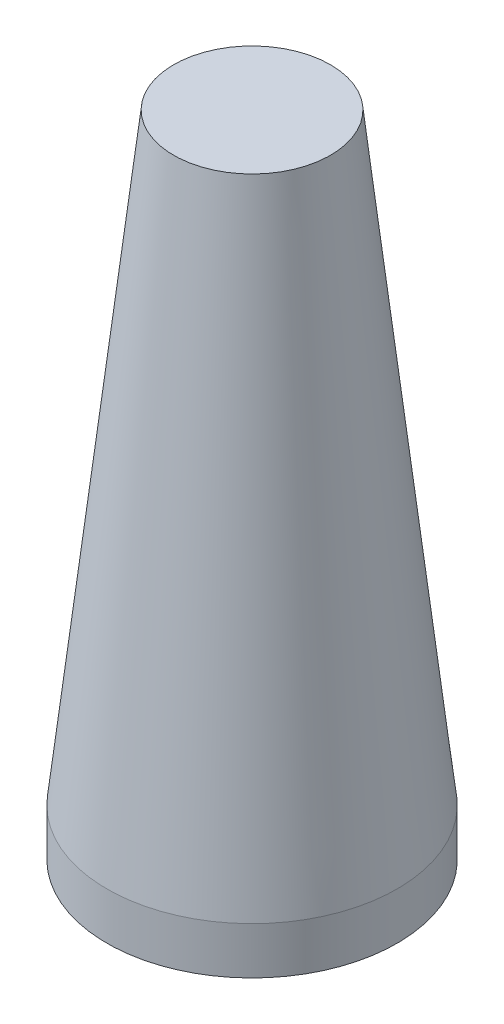
ISO-10303-21;
HEADER;
FILE_DESCRIPTION(('STEP AP214'),'2;1');
FILE_NAME('part.step','',(''),(''),'','','');
FILE_SCHEMA(('AUTOMOTIVE_DESIGN { 1 0 10303 214 1 1 1 1 }'));
ENDSEC;
DATA;
#1=APPLICATION_CONTEXT('core data for automotive mechanical design processes');
#2=APPLICATION_PROTOCOL_DEFINITION('international standard','automotive_design',2000,#1);
#3=PRODUCT_CONTEXT('',#1,'mechanical');
#4=PRODUCT('Part','Part','',(#3));
#5=PRODUCT_RELATED_PRODUCT_CATEGORY('part','',(#4));
#6=PRODUCT_DEFINITION_FORMATION('','',#4);
#7=PRODUCT_DEFINITION_CONTEXT('part definition',#1,'design');
#8=PRODUCT_DEFINITION('design','',#6,#7);
#9=PRODUCT_DEFINITION_SHAPE('','',#8);
#10=(LENGTH_UNIT() NAMED_UNIT(*) SI_UNIT(.MILLI.,.METRE.));
#11=(NAMED_UNIT(*) PLANE_ANGLE_UNIT() SI_UNIT($,.RADIAN.));
#12=(NAMED_UNIT(*) SI_UNIT($,.STERADIAN.) SOLID_ANGLE_UNIT());
#13=UNCERTAINTY_MEASURE_WITH_UNIT(LENGTH_MEASURE(1.E-05),#10,'distance_accuracy_value','');
#14=(GEOMETRIC_REPRESENTATION_CONTEXT(3) GLOBAL_UNCERTAINTY_ASSIGNED_CONTEXT((#13)) GLOBAL_UNIT_ASSIGNED_CONTEXT((#10,
#11,#12)) REPRESENTATION_CONTEXT('',''));
#15=CARTESIAN_POINT('',(0.,0.,0.));
#16=DIRECTION('',(0.,0.,1.));
#17=DIRECTION('',(1.,0.,0.));
#18=AXIS2_PLACEMENT_3D('',#15,#16,#17);
#19=CARTESIAN_POINT('',(0.,790.,0.));
#20=DIRECTION('',(0.,-1.,0.));
#21=DIRECTION('',(0.,0.,-1.));
#22=AXIS2_PLACEMENT_3D('',#19,#20,#21);
#23=PLANE('',#22);
#24=CARTESIAN_POINT('',(0.,790.,0.));
#25=DIRECTION('',(0.,-1.,0.));
#26=DIRECTION('',(0.,0.,-1.));
#27=AXIS2_PLACEMENT_3D('',#24,#25,#26);
#28=CIRCLE('',#27,94.0646952284262);
#29=CARTESIAN_POINT('',(0.,790.,-94.0646952284262));
#30=VERTEX_POINT('',#29);
#31=EDGE_CURVE('E90',#30,#30,#28,.T.);
#32=ORIENTED_EDGE('',*,*,#31,.T.);
#33=EDGE_LOOP('',(#32));
#34=FACE_BOUND('',#33,.T.);
#35=ADVANCED_FACE('F46',(#34),#23,.T.);
#36=CARTESIAN_POINT('',(8.88178419700125E-13,800.,0.));
#37=DIRECTION('',(0.,-1.,0.));
#38=DIRECTION('',(0.,0.,-1.));
#39=AXIS2_PLACEMENT_3D('',#36,#37,#38);
#40=PLANE('',#39);
#41=CARTESIAN_POINT('',(0.,800.,0.));
#42=DIRECTION('',(0.,-1.,0.));
#43=DIRECTION('',(0.,0.,-1.));
#44=AXIS2_PLACEMENT_3D('',#41,#42,#43);
#45=CIRCLE('',#44,100.);
#46=CARTESIAN_POINT('',(0.,800.,-100.));
#47=VERTEX_POINT('',#46);
#48=EDGE_CURVE('E10',#47,#47,#45,.T.);
#49=ORIENTED_EDGE('',*,*,#48,.F.);
#50=EDGE_LOOP('',(#49));
#51=FACE_BOUND('',#50,.T.);
#52=ADVANCED_FACE('F167',(#51),#40,.F.);
#53=CARTESIAN_POINT('',(0.,800.,0.));
#54=DIRECTION('',(0.,-1.,0.));
#55=DIRECTION('',(0.,0.,-1.));
#56=AXIS2_PLACEMENT_3D('',#53,#54,#55);
#57=CONICAL_SURFACE('',#56,100.,0.110299842515484);
#58=CARTESIAN_POINT('',(0.,32.5010329470448,0.));
#59=DIRECTION('',(0.,-1.,0.));
#60=DIRECTION('',(0.,0.,-1.));
#61=AXIS2_PLACEMENT_3D('',#58,#59,#60);
#62=CIRCLE('',#61,185.);
#63=CARTESIAN_POINT('',(0.,32.5010329470448,-185.));
#64=VERTEX_POINT('',#63);
#65=EDGE_CURVE('E54',#64,#64,#62,.T.);
#66=ORIENTED_EDGE('',*,*,#65,.F.);
#67=EDGE_LOOP('',(#66));
#68=FACE_BOUND('',#67,.T.);
#69=ORIENTED_EDGE('',*,*,#48,.T.);
#70=EDGE_LOOP('',(#69));
#71=FACE_BOUND('',#70,.T.);
#72=ADVANCED_FACE('F165',(#68,#71),#57,.T.);
#73=CARTESIAN_POINT('',(0.,-27.4989670529552,0.));
#74=DIRECTION('',(0.,-1.,0.));
#75=DIRECTION('',(0.,0.,-1.));
#76=AXIS2_PLACEMENT_3D('',#73,#74,#75);
#77=CYLINDRICAL_SURFACE('',#76,185.);
#78=ORIENTED_EDGE('',*,*,#65,.T.);
#79=EDGE_LOOP('',(#78));
#80=FACE_BOUND('',#79,.T.);
#81=CARTESIAN_POINT('',(0.,-27.4989670529552,0.));
#82=DIRECTION('',(0.,-1.,0.));
#83=DIRECTION('',(0.,0.,-1.));
#84=AXIS2_PLACEMENT_3D('',#81,#82,#83);
#85=CIRCLE('',#84,185.);
#86=CARTESIAN_POINT('',(0.,-27.4989670529552,-185.));
#87=VERTEX_POINT('',#86);
#88=EDGE_CURVE('E59',#87,#87,#85,.T.);
#89=ORIENTED_EDGE('',*,*,#88,.F.);
#90=EDGE_LOOP('',(#89));
#91=FACE_BOUND('',#90,.T.);
#92=ADVANCED_FACE('F161',(#80,#91),#77,.T.);
#93=CARTESIAN_POINT('',(0.,-27.4989670529552,0.));
#94=DIRECTION('',(0.,-1.,0.));
#95=DIRECTION('',(0.,0.,-1.));
#96=AXIS2_PLACEMENT_3D('',#93,#94,#95);
#97=PLANE('',#96);
#98=ORIENTED_EDGE('',*,*,#88,.T.);
#99=EDGE_LOOP('',(#98));
#100=FACE_BOUND('',#99,.T.);
#101=CARTESIAN_POINT('',(0.,-27.4989670529552,0.));
#102=DIRECTION('',(0.,-1.,0.));
#103=DIRECTION('',(0.,0.,-1.));
#104=AXIS2_PLACEMENT_3D('',#101,#102,#103);
#105=CIRCLE('',#104,178.);
#106=CARTESIAN_POINT('',(0.,-27.4989670529552,-178.));
#107=VERTEX_POINT('',#106);
#108=EDGE_CURVE('E64',#107,#107,#105,.T.);
#109=ORIENTED_EDGE('',*,*,#108,.F.);
#110=EDGE_LOOP('',(#109));
#111=FACE_BOUND('',#110,.T.);
#112=ADVANCED_FACE('F157',(#100,#111),#97,.T.);
#113=CARTESIAN_POINT('',(0.,-27.4989670529552,0.));
#114=DIRECTION('',(0.,-1.,0.));
#115=DIRECTION('',(0.,0.,-1.));
#116=AXIS2_PLACEMENT_3D('',#113,#114,#115);
#117=CYLINDRICAL_SURFACE('',#116,178.);
#118=ORIENTED_EDGE('',*,*,#108,.T.);
#119=EDGE_LOOP('',(#118));
#120=FACE_BOUND('',#119,.T.);
#121=CARTESIAN_POINT('',(0.,32.5010329470448,0.));
#122=DIRECTION('',(0.,-1.,0.));
#123=DIRECTION('',(0.,0.,-1.));
#124=AXIS2_PLACEMENT_3D('',#121,#122,#123);
#125=CIRCLE('',#124,178.);
#126=CARTESIAN_POINT('',(0.,32.5010329470448,-178.));
#127=VERTEX_POINT('',#126);
#128=EDGE_CURVE('E70',#127,#127,#125,.T.);
#129=ORIENTED_EDGE('',*,*,#128,.F.);
#130=EDGE_LOOP('',(#129));
#131=FACE_BOUND('',#130,.T.);
#132=ADVANCED_FACE('F153',(#120,#131),#117,.F.);
#133=CARTESIAN_POINT('',(0.,92.5010329470448,0.));
#134=DIRECTION('',(0.,-1.,0.));
#135=DIRECTION('',(0.,0.,-1.));
#136=AXIS2_PLACEMENT_3D('',#133,#134,#135);
#137=CONICAL_SURFACE('',#136,171.350171874753,0.110379992752529);
#138=ORIENTED_EDGE('',*,*,#128,.T.);
#139=EDGE_LOOP('',(#138));
#140=FACE_BOUND('',#139,.T.);
#141=CARTESIAN_POINT('',(0.,92.5010329470448,0.));
#142=DIRECTION('',(0.,-1.,0.));
#143=DIRECTION('',(0.,0.,-1.));
#144=AXIS2_PLACEMENT_3D('',#141,#142,#143);
#145=CIRCLE('',#144,171.350171874753);
#146=CARTESIAN_POINT('',(0.,92.5010329470448,-171.350171874753));
#147=VERTEX_POINT('',#146);
#148=EDGE_CURVE('E74',#147,#147,#145,.T.);
#149=ORIENTED_EDGE('',*,*,#148,.F.);
#150=EDGE_LOOP('',(#149));
#151=FACE_BOUND('',#150,.T.);
#152=ADVANCED_FACE('F149',(#140,#151),#137,.F.);
#153=CARTESIAN_POINT('',(0.,92.5010329470448,0.));
#154=DIRECTION('',(0.,-1.,0.));
#155=DIRECTION('',(0.,0.,-1.));
#156=AXIS2_PLACEMENT_3D('',#153,#154,#155);
#157=PLANE('',#156);
#158=ORIENTED_EDGE('',*,*,#148,.T.);
#159=EDGE_LOOP('',(#158));
#160=FACE_BOUND('',#159,.T.);
#161=CARTESIAN_POINT('',(0.,92.5010329470448,0.));
#162=DIRECTION('',(0.,-1.,0.));
#163=DIRECTION('',(0.,0.,-1.));
#164=AXIS2_PLACEMENT_3D('',#161,#162,#163);
#165=CIRCLE('',#164,20.);
#166=CARTESIAN_POINT('',(0.,92.5010329470448,-20.));
#167=VERTEX_POINT('',#166);
#168=EDGE_CURVE('E78',#167,#167,#165,.T.);
#169=ORIENTED_EDGE('',*,*,#168,.F.);
#170=EDGE_LOOP('',(#169));
#171=FACE_BOUND('',#170,.T.);
#172=ADVANCED_FACE('F145',(#160,#171),#157,.T.);
#173=CARTESIAN_POINT('',(0.,-27.4989670529552,0.));
#174=DIRECTION('',(0.,-1.,0.));
#175=DIRECTION('',(0.,0.,-1.));
#176=AXIS2_PLACEMENT_3D('',#173,#174,#175);
#177=CYLINDRICAL_SURFACE('',#176,20.);
#178=ORIENTED_EDGE('',*,*,#168,.T.);
#179=EDGE_LOOP('',(#178));
#180=FACE_BOUND('',#179,.T.);
#181=CARTESIAN_POINT('',(0.,570.,0.));
#182=DIRECTION('',(0.,-1.,0.));
#183=DIRECTION('',(0.,0.,-1.));
#184=AXIS2_PLACEMENT_3D('',#181,#182,#183);
#185=CIRCLE('',#184,20.);
#186=CARTESIAN_POINT('',(0.,570.,-20.));
#187=VERTEX_POINT('',#186);
#188=EDGE_CURVE('E82',#187,#187,#185,.T.);
#189=ORIENTED_EDGE('',*,*,#188,.F.);
#190=EDGE_LOOP('',(#189));
#191=FACE_BOUND('',#190,.T.);
#192=ADVANCED_FACE('F141',(#180,#191),#177,.F.);
#193=CARTESIAN_POINT('',(0.,570.,0.));
#194=DIRECTION('',(0.,-1.,0.));
#195=DIRECTION('',(0.,0.,-1.));
#196=AXIS2_PLACEMENT_3D('',#193,#194,#195);
#197=PLANE('',#196);
#198=CARTESIAN_POINT('',(0.,570.,0.));
#199=DIRECTION('',(0.,-1.,0.));
#200=DIRECTION('',(0.,0.,-1.));
#201=AXIS2_PLACEMENT_3D('',#198,#199,#200);
#202=CIRCLE('',#201,118.429548866998);
#203=CARTESIAN_POINT('',(0.,570.,-118.429548866998));
#204=VERTEX_POINT('',#203);
#205=EDGE_CURVE('E86',#204,#204,#202,.T.);
#206=ORIENTED_EDGE('',*,*,#205,.F.);
#207=EDGE_LOOP('',(#206));
#208=FACE_BOUND('',#207,.T.);
#209=ORIENTED_EDGE('',*,*,#188,.T.);
#210=EDGE_LOOP('',(#209));
#211=FACE_BOUND('',#210,.T.);
#212=ADVANCED_FACE('F137',(#208,#211),#197,.F.);
#213=CARTESIAN_POINT('',(0.,790.,0.));
#214=DIRECTION('',(0.,-1.,0.));
#215=DIRECTION('',(0.,0.,-1.));
#216=AXIS2_PLACEMENT_3D('',#213,#214,#215);
#217=CONICAL_SURFACE('',#216,94.0646952284262,0.110299842515484);
#218=ORIENTED_EDGE('',*,*,#205,.T.);
#219=EDGE_LOOP('',(#218));
#220=FACE_BOUND('',#219,.T.);
#221=ORIENTED_EDGE('',*,*,#31,.F.);
#222=EDGE_LOOP('',(#221));
#223=FACE_BOUND('',#222,.T.);
#224=ADVANCED_FACE('F135',(#220,#223),#217,.F.);
#225=CLOSED_SHELL('',(#35,#52,#72,#92,#112,#132,#152,#172,#192,#212,#224));
#226=CARTESIAN_POINT('',(0.,560.,0.));
#227=DIRECTION('',(0.,-1.,0.));
#228=DIRECTION('',(0.,0.,-1.));
#229=AXIS2_PLACEMENT_3D('',#226,#227,#228);
#230=PLANE('',#229);
#231=CARTESIAN_POINT('',(0.,560.,0.));
#232=DIRECTION('',(0.,-1.,0.));
#233=DIRECTION('',(0.,0.,-1.));
#234=AXIS2_PLACEMENT_3D('',#231,#232,#233);
#235=CIRCLE('',#234,119.537042214205);
#236=CARTESIAN_POINT('',(0.,560.,-119.537042214205));
#237=VERTEX_POINT('',#236);
#238=EDGE_CURVE('E106',#237,#237,#235,.T.);
#239=ORIENTED_EDGE('',*,*,#238,.T.);
#240=EDGE_LOOP('',(#239));
#241=FACE_BOUND('',#240,.T.);
#242=CARTESIAN_POINT('',(0.,560.,0.));
#243=DIRECTION('',(0.,-1.,0.));
#244=DIRECTION('',(0.,0.,-1.));
#245=AXIS2_PLACEMENT_3D('',#242,#243,#244);
#246=CIRCLE('',#245,27.0000000000001);
#247=CARTESIAN_POINT('',(0.,560.,-27.0000000000001));
#248=VERTEX_POINT('',#247);
#249=EDGE_CURVE('E94',#248,#248,#246,.T.);
#250=ORIENTED_EDGE('',*,*,#249,.F.);
#251=EDGE_LOOP('',(#250));
#252=FACE_BOUND('',#251,.T.);
#253=ADVANCED_FACE('F111',(#241,#252),#230,.T.);
#254=CARTESIAN_POINT('',(0.,-27.4989670529552,0.));
#255=DIRECTION('',(0.,-1.,0.));
#256=DIRECTION('',(0.,0.,-1.));
#257=AXIS2_PLACEMENT_3D('',#254,#255,#256);
#258=CYLINDRICAL_SURFACE('',#257,27.);
#259=CARTESIAN_POINT('',(0.,102.501032947045,0.));
#260=DIRECTION('',(0.,-1.,0.));
#261=DIRECTION('',(0.,0.,-1.));
#262=AXIS2_PLACEMENT_3D('',#259,#260,#261);
#263=CIRCLE('',#262,27.);
#264=CARTESIAN_POINT('',(0.,102.501032947045,-27.));
#265=VERTEX_POINT('',#264);
#266=EDGE_CURVE('E98',#265,#265,#263,.T.);
#267=ORIENTED_EDGE('',*,*,#266,.F.);
#268=EDGE_LOOP('',(#267));
#269=FACE_BOUND('',#268,.T.);
#270=ORIENTED_EDGE('',*,*,#249,.T.);
#271=EDGE_LOOP('',(#270));
#272=FACE_BOUND('',#271,.T.);
#273=ADVANCED_FACE('F123',(#269,#272),#258,.T.);
#274=CARTESIAN_POINT('',(0.,102.501032947045,0.));
#275=DIRECTION('',(0.,-1.,0.));
#276=DIRECTION('',(0.,0.,-1.));
#277=AXIS2_PLACEMENT_3D('',#274,#275,#276);
#278=PLANE('',#277);
#279=CARTESIAN_POINT('',(0.,102.501032947045,0.));
#280=DIRECTION('',(0.,-1.,0.));
#281=DIRECTION('',(0.,0.,-1.));
#282=AXIS2_PLACEMENT_3D('',#279,#280,#281);
#283=CIRCLE('',#282,170.241867187211);
#284=CARTESIAN_POINT('',(0.,102.501032947045,-170.241867187211));
#285=VERTEX_POINT('',#284);
#286=EDGE_CURVE('E102',#285,#285,#283,.T.);
#287=ORIENTED_EDGE('',*,*,#286,.F.);
#288=EDGE_LOOP('',(#287));
#289=FACE_BOUND('',#288,.T.);
#290=ORIENTED_EDGE('',*,*,#266,.T.);
#291=EDGE_LOOP('',(#290));
#292=FACE_BOUND('',#291,.T.);
#293=ADVANCED_FACE('F116',(#289,#292),#278,.F.);
#294=CARTESIAN_POINT('',(0.,560.,0.));
#295=DIRECTION('',(0.,-1.,0.));
#296=DIRECTION('',(0.,0.,-1.));
#297=AXIS2_PLACEMENT_3D('',#294,#295,#296);
#298=CONICAL_SURFACE('',#297,119.537042214205,0.110379992752529);
#299=ORIENTED_EDGE('',*,*,#286,.T.);
#300=EDGE_LOOP('',(#299));
#301=FACE_BOUND('',#300,.T.);
#302=ORIENTED_EDGE('',*,*,#238,.F.);
#303=EDGE_LOOP('',(#302));
#304=FACE_BOUND('',#303,.T.);
#305=ADVANCED_FACE('F114',(#301,#304),#298,.F.);
#306=CLOSED_SHELL('',(#253,#273,#293,#305));
#307=ORIENTED_CLOSED_SHELL('',*,#306,.T.);
#308=BREP_WITH_VOIDS('B2',#225,(#307));
#309=ADVANCED_BREP_SHAPE_REPRESENTATION('',(#18,#308),#14);
#310=SHAPE_DEFINITION_REPRESENTATION(#9,#309);
ENDSEC;
END-ISO-10303-21;
